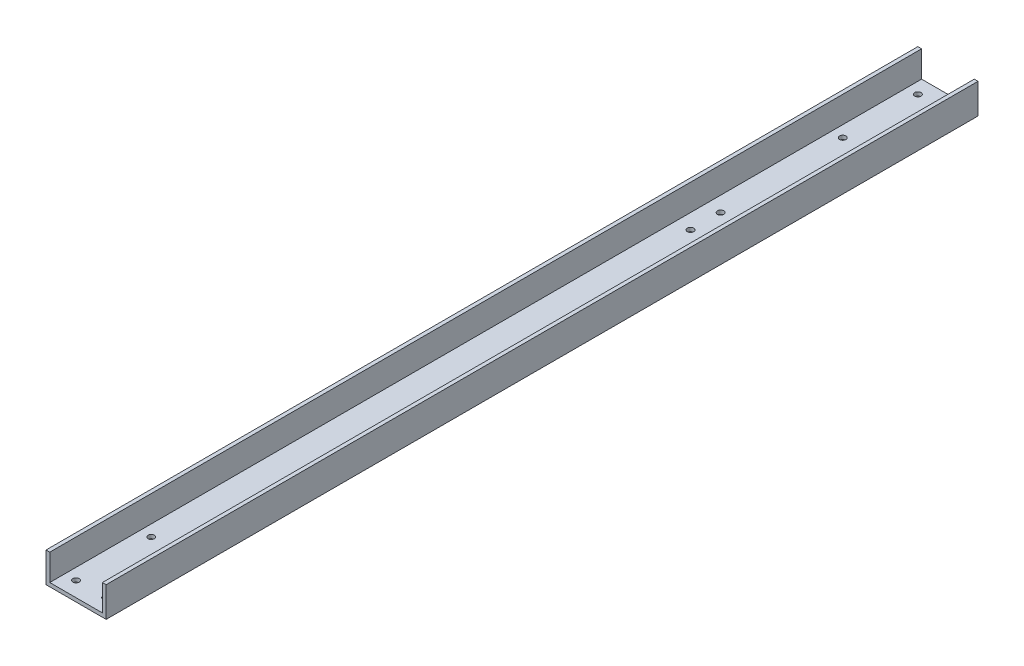
ISO-10303-21;
HEADER;
FILE_DESCRIPTION(('STEP AP214'),'2;1');
FILE_NAME('part.step','',(''),(''),'','','');
FILE_SCHEMA(('AUTOMOTIVE_DESIGN { 1 0 10303 214 1 1 1 1 }'));
ENDSEC;
DATA;
#1=APPLICATION_CONTEXT('core data for automotive mechanical design processes');
#2=APPLICATION_PROTOCOL_DEFINITION('international standard','automotive_design',2000,#1);
#3=PRODUCT_CONTEXT('',#1,'mechanical');
#4=PRODUCT('Part','Part','',(#3));
#5=PRODUCT_RELATED_PRODUCT_CATEGORY('part','',(#4));
#6=PRODUCT_DEFINITION_FORMATION('','',#4);
#7=PRODUCT_DEFINITION_CONTEXT('part definition',#1,'design');
#8=PRODUCT_DEFINITION('design','',#6,#7);
#9=PRODUCT_DEFINITION_SHAPE('','',#8);
#10=(LENGTH_UNIT() NAMED_UNIT(*) SI_UNIT(.MILLI.,.METRE.));
#11=(NAMED_UNIT(*) PLANE_ANGLE_UNIT() SI_UNIT($,.RADIAN.));
#12=(NAMED_UNIT(*) SI_UNIT($,.STERADIAN.) SOLID_ANGLE_UNIT());
#13=UNCERTAINTY_MEASURE_WITH_UNIT(LENGTH_MEASURE(1.E-05),#10,'distance_accuracy_value','');
#14=(GEOMETRIC_REPRESENTATION_CONTEXT(3) GLOBAL_UNCERTAINTY_ASSIGNED_CONTEXT((#13)) GLOBAL_UNIT_ASSIGNED_CONTEXT((#10,
#11,#12)) REPRESENTATION_CONTEXT('',''));
#15=CARTESIAN_POINT('',(0.,0.,0.));
#16=DIRECTION('',(0.,0.,1.));
#17=DIRECTION('',(1.,0.,0.));
#18=AXIS2_PLACEMENT_3D('',#15,#16,#17);
#19=CARTESIAN_POINT('',(0.,0.,736.6));
#20=DIRECTION('',(1.,0.,0.));
#21=DIRECTION('',(0.,0.,-1.));
#22=AXIS2_PLACEMENT_3D('',#19,#20,#21);
#23=PLANE('',#22);
#24=DIRECTION('',(0.,-1.,0.));
#25=VECTOR('',#24,1.);
#26=CARTESIAN_POINT('',(0.,0.,0.));
#27=LINE('',#26,#25);
#28=CARTESIAN_POINT('',(0.,25.4,0.));
#29=VERTEX_POINT('',#28);
#30=CARTESIAN_POINT('',(0.,0.,0.));
#31=VERTEX_POINT('',#30);
#32=EDGE_CURVE('E138',#29,#31,#27,.T.);
#33=ORIENTED_EDGE('',*,*,#32,.T.);
#34=DIRECTION('',(0.,0.,-1.));
#35=VECTOR('',#34,1.);
#36=CARTESIAN_POINT('',(0.,0.,736.6));
#37=LINE('',#36,#35);
#38=CARTESIAN_POINT('',(0.,0.,736.6));
#39=VERTEX_POINT('',#38);
#40=EDGE_CURVE('E11',#39,#31,#37,.T.);
#41=ORIENTED_EDGE('',*,*,#40,.F.);
#42=DIRECTION('',(0.,-1.,0.));
#43=VECTOR('',#42,1.);
#44=CARTESIAN_POINT('',(0.,0.,736.6));
#45=LINE('',#44,#43);
#46=CARTESIAN_POINT('',(0.,25.4,736.6));
#47=VERTEX_POINT('',#46);
#48=EDGE_CURVE('E157',#47,#39,#45,.T.);
#49=ORIENTED_EDGE('',*,*,#48,.F.);
#50=DIRECTION('',(0.,0.,-1.));
#51=VECTOR('',#50,1.);
#52=CARTESIAN_POINT('',(0.,25.4,736.6));
#53=LINE('',#52,#51);
#54=EDGE_CURVE('E134',#47,#29,#53,.T.);
#55=ORIENTED_EDGE('',*,*,#54,.T.);
#56=EDGE_LOOP('',(#33,#41,#49,#55));
#57=FACE_BOUND('',#56,.T.);
#58=ADVANCED_FACE('F38',(#57),#23,.F.);
#59=CARTESIAN_POINT('',(0.,0.,736.6));
#60=DIRECTION('',(0.,1.,0.));
#61=DIRECTION('',(0.,0.,1.));
#62=AXIS2_PLACEMENT_3D('',#59,#60,#61);
#63=PLANE('',#62);
#64=CARTESIAN_POINT('',(15.8750000000001,0.,207.937100000006));
#65=DIRECTION('',(0.,1.,0.));
#66=DIRECTION('',(0.,0.,1.));
#67=AXIS2_PLACEMENT_3D('',#64,#65,#66);
#68=CIRCLE('',#67,2.667);
#69=CARTESIAN_POINT('',(15.8750000000001,0.,210.604100000006));
#70=VERTEX_POINT('',#69);
#71=EDGE_CURVE('E255',#70,#70,#68,.F.);
#72=ORIENTED_EDGE('',*,*,#71,.F.);
#73=EDGE_LOOP('',(#72));
#74=FACE_BOUND('',#73,.T.);
#75=CARTESIAN_POINT('',(34.9250000000001,0.,182.537100000006));
#76=DIRECTION('',(0.,1.,0.));
#77=DIRECTION('',(0.,0.,1.));
#78=AXIS2_PLACEMENT_3D('',#75,#76,#77);
#79=CIRCLE('',#78,2.667);
#80=CARTESIAN_POINT('',(34.9250000000001,0.,185.204100000006));
#81=VERTEX_POINT('',#80);
#82=EDGE_CURVE('E264',#81,#81,#79,.F.);
#83=ORIENTED_EDGE('',*,*,#82,.F.);
#84=EDGE_LOOP('',(#83));
#85=FACE_BOUND('',#84,.T.);
#86=CARTESIAN_POINT('',(15.8750000000001,0.,182.537100000006));
#87=DIRECTION('',(0.,1.,0.));
#88=DIRECTION('',(0.,0.,1.));
#89=AXIS2_PLACEMENT_3D('',#86,#87,#88);
#90=CIRCLE('',#89,2.667);
#91=CARTESIAN_POINT('',(15.8750000000001,0.,185.204100000006));
#92=VERTEX_POINT('',#91);
#93=EDGE_CURVE('E256',#92,#92,#90,.F.);
#94=ORIENTED_EDGE('',*,*,#93,.F.);
#95=EDGE_LOOP('',(#94));
#96=FACE_BOUND('',#95,.T.);
#97=CARTESIAN_POINT('',(34.9250000000001,0.,207.937100000006));
#98=DIRECTION('',(0.,1.,0.));
#99=DIRECTION('',(0.,0.,1.));
#100=AXIS2_PLACEMENT_3D('',#97,#98,#99);
#101=CIRCLE('',#100,2.667);
#102=CARTESIAN_POINT('',(34.9250000000001,0.,210.604100000006));
#103=VERTEX_POINT('',#102);
#104=EDGE_CURVE('E213',#103,#103,#101,.F.);
#105=ORIENTED_EDGE('',*,*,#104,.F.);
#106=EDGE_LOOP('',(#105));
#107=FACE_BOUND('',#106,.T.);
#108=CARTESIAN_POINT('',(12.7,0.,660.4));
#109=DIRECTION('',(0.,1.,0.));
#110=DIRECTION('',(0.,0.,1.));
#111=AXIS2_PLACEMENT_3D('',#108,#109,#110);
#112=CIRCLE('',#111,2.667);
#113=CARTESIAN_POINT('',(12.7,0.,663.067));
#114=VERTEX_POINT('',#113);
#115=EDGE_CURVE('E203',#114,#114,#112,.F.);
#116=ORIENTED_EDGE('',*,*,#115,.F.);
#117=EDGE_LOOP('',(#116));
#118=FACE_BOUND('',#117,.T.);
#119=CARTESIAN_POINT('',(38.1,0.,660.4));
#120=DIRECTION('',(0.,1.,0.));
#121=DIRECTION('',(0.,0.,1.));
#122=AXIS2_PLACEMENT_3D('',#119,#120,#121);
#123=CIRCLE('',#122,2.667);
#124=CARTESIAN_POINT('',(38.1,0.,663.067));
#125=VERTEX_POINT('',#124);
#126=EDGE_CURVE('E239',#125,#125,#123,.F.);
#127=ORIENTED_EDGE('',*,*,#126,.F.);
#128=EDGE_LOOP('',(#127));
#129=FACE_BOUND('',#128,.T.);
#130=CARTESIAN_POINT('',(38.1,0.,723.9));
#131=DIRECTION('',(0.,1.,0.));
#132=DIRECTION('',(0.,0.,1.));
#133=AXIS2_PLACEMENT_3D('',#130,#131,#132);
#134=CIRCLE('',#133,2.667);
#135=CARTESIAN_POINT('',(38.1,0.,726.567));
#136=VERTEX_POINT('',#135);
#137=EDGE_CURVE('E233',#136,#136,#134,.F.);
#138=ORIENTED_EDGE('',*,*,#137,.F.);
#139=EDGE_LOOP('',(#138));
#140=FACE_BOUND('',#139,.T.);
#141=CARTESIAN_POINT('',(38.1,0.,12.7));
#142=DIRECTION('',(0.,1.,0.));
#143=DIRECTION('',(0.,0.,1.));
#144=AXIS2_PLACEMENT_3D('',#141,#142,#143);
#145=CIRCLE('',#144,2.667);
#146=CARTESIAN_POINT('',(38.1,0.,15.367));
#147=VERTEX_POINT('',#146);
#148=EDGE_CURVE('E227',#147,#147,#145,.F.);
#149=ORIENTED_EDGE('',*,*,#148,.F.);
#150=EDGE_LOOP('',(#149));
#151=FACE_BOUND('',#150,.T.);
#152=CARTESIAN_POINT('',(38.1,0.,76.2));
#153=DIRECTION('',(0.,1.,0.));
#154=DIRECTION('',(0.,0.,1.));
#155=AXIS2_PLACEMENT_3D('',#152,#153,#154);
#156=CIRCLE('',#155,2.667);
#157=CARTESIAN_POINT('',(38.1,0.,78.867));
#158=VERTEX_POINT('',#157);
#159=EDGE_CURVE('E220',#158,#158,#156,.F.);
#160=ORIENTED_EDGE('',*,*,#159,.F.);
#161=EDGE_LOOP('',(#160));
#162=FACE_BOUND('',#161,.T.);
#163=CARTESIAN_POINT('',(12.7,0.,12.7));
#164=DIRECTION('',(0.,1.,0.));
#165=DIRECTION('',(0.,0.,1.));
#166=AXIS2_PLACEMENT_3D('',#163,#164,#165);
#167=CIRCLE('',#166,2.667);
#168=CARTESIAN_POINT('',(12.7,0.,15.367));
#169=VERTEX_POINT('',#168);
#170=EDGE_CURVE('E214',#169,#169,#167,.F.);
#171=ORIENTED_EDGE('',*,*,#170,.F.);
#172=EDGE_LOOP('',(#171));
#173=FACE_BOUND('',#172,.T.);
#174=CARTESIAN_POINT('',(12.7,0.,76.2));
#175=DIRECTION('',(0.,1.,0.));
#176=DIRECTION('',(0.,0.,1.));
#177=AXIS2_PLACEMENT_3D('',#174,#175,#176);
#178=CIRCLE('',#177,2.667);
#179=CARTESIAN_POINT('',(12.7,0.,78.867));
#180=VERTEX_POINT('',#179);
#181=EDGE_CURVE('E204',#180,#180,#178,.F.);
#182=ORIENTED_EDGE('',*,*,#181,.F.);
#183=EDGE_LOOP('',(#182));
#184=FACE_BOUND('',#183,.T.);
#185=CARTESIAN_POINT('',(12.7,0.,723.9));
#186=DIRECTION('',(0.,1.,0.));
#187=DIRECTION('',(0.,0.,1.));
#188=AXIS2_PLACEMENT_3D('',#185,#186,#187);
#189=CIRCLE('',#188,2.667);
#190=CARTESIAN_POINT('',(12.7,0.,726.567));
#191=VERTEX_POINT('',#190);
#192=EDGE_CURVE('E143',#191,#191,#189,.F.);
#193=ORIENTED_EDGE('',*,*,#192,.F.);
#194=EDGE_LOOP('',(#193));
#195=FACE_BOUND('',#194,.T.);
#196=DIRECTION('',(1.,0.,0.));
#197=VECTOR('',#196,1.);
#198=CARTESIAN_POINT('',(0.,0.,0.));
#199=LINE('',#198,#197);
#200=CARTESIAN_POINT('',(50.8,0.,0.));
#201=VERTEX_POINT('',#200);
#202=EDGE_CURVE('E142',#31,#201,#199,.T.);
#203=ORIENTED_EDGE('',*,*,#202,.T.);
#204=DIRECTION('',(0.,0.,-1.));
#205=VECTOR('',#204,1.);
#206=CARTESIAN_POINT('',(50.8,0.,736.6));
#207=LINE('',#206,#205);
#208=CARTESIAN_POINT('',(50.8,0.,736.6));
#209=VERTEX_POINT('',#208);
#210=EDGE_CURVE('E47',#209,#201,#207,.T.);
#211=ORIENTED_EDGE('',*,*,#210,.F.);
#212=DIRECTION('',(1.,0.,0.));
#213=VECTOR('',#212,1.);
#214=CARTESIAN_POINT('',(0.,0.,736.6));
#215=LINE('',#214,#213);
#216=EDGE_CURVE('E100',#39,#209,#215,.T.);
#217=ORIENTED_EDGE('',*,*,#216,.F.);
#218=ORIENTED_EDGE('',*,*,#40,.T.);
#219=EDGE_LOOP('',(#203,#211,#217,#218));
#220=FACE_BOUND('',#219,.T.);
#221=ADVANCED_FACE('F312',(#74,#85,#96,#107,#118,#129,#140,#151,#162,#173,#184,#195,#220),#63,.F.);
#222=CARTESIAN_POINT('',(50.8,0.,736.6));
#223=DIRECTION('',(-1.,0.,0.));
#224=DIRECTION('',(0.,0.,1.));
#225=AXIS2_PLACEMENT_3D('',#222,#223,#224);
#226=PLANE('',#225);
#227=DIRECTION('',(0.,1.,0.));
#228=VECTOR('',#227,1.);
#229=CARTESIAN_POINT('',(50.8,0.,0.));
#230=LINE('',#229,#228);
#231=CARTESIAN_POINT('',(50.8,25.4,0.));
#232=VERTEX_POINT('',#231);
#233=EDGE_CURVE('E145',#201,#232,#230,.T.);
#234=ORIENTED_EDGE('',*,*,#233,.T.);
#235=DIRECTION('',(0.,0.,-1.));
#236=VECTOR('',#235,1.);
#237=CARTESIAN_POINT('',(50.8,25.4,736.6));
#238=LINE('',#237,#236);
#239=CARTESIAN_POINT('',(50.8,25.4,736.6));
#240=VERTEX_POINT('',#239);
#241=EDGE_CURVE('E168',#240,#232,#238,.T.);
#242=ORIENTED_EDGE('',*,*,#241,.F.);
#243=DIRECTION('',(0.,1.,0.));
#244=VECTOR('',#243,1.);
#245=CARTESIAN_POINT('',(50.8,0.,736.6));
#246=LINE('',#245,#244);
#247=EDGE_CURVE('E180',#209,#240,#246,.T.);
#248=ORIENTED_EDGE('',*,*,#247,.F.);
#249=ORIENTED_EDGE('',*,*,#210,.T.);
#250=EDGE_LOOP('',(#234,#242,#248,#249));
#251=FACE_BOUND('',#250,.T.);
#252=ADVANCED_FACE('F178',(#251),#226,.F.);
#253=CARTESIAN_POINT('',(47.625,25.4,736.6));
#254=DIRECTION('',(0.,-1.,0.));
#255=DIRECTION('',(0.,0.,-1.));
#256=AXIS2_PLACEMENT_3D('',#253,#254,#255);
#257=PLANE('',#256);
#258=DIRECTION('',(-1.,0.,0.));
#259=VECTOR('',#258,1.);
#260=CARTESIAN_POINT('',(47.625,25.4,0.));
#261=LINE('',#260,#259);
#262=CARTESIAN_POINT('',(47.625,25.4,0.));
#263=VERTEX_POINT('',#262);
#264=EDGE_CURVE('E147',#232,#263,#261,.T.);
#265=ORIENTED_EDGE('',*,*,#264,.T.);
#266=DIRECTION('',(0.,0.,-1.));
#267=VECTOR('',#266,1.);
#268=CARTESIAN_POINT('',(47.625,25.4,736.6));
#269=LINE('',#268,#267);
#270=CARTESIAN_POINT('',(47.625,25.4,736.6));
#271=VERTEX_POINT('',#270);
#272=EDGE_CURVE('E164',#271,#263,#269,.T.);
#273=ORIENTED_EDGE('',*,*,#272,.F.);
#274=DIRECTION('',(-1.,0.,0.));
#275=VECTOR('',#274,1.);
#276=CARTESIAN_POINT('',(47.625,25.4,736.6));
#277=LINE('',#276,#275);
#278=EDGE_CURVE('E192',#240,#271,#277,.T.);
#279=ORIENTED_EDGE('',*,*,#278,.F.);
#280=ORIENTED_EDGE('',*,*,#241,.T.);
#281=EDGE_LOOP('',(#265,#273,#279,#280));
#282=FACE_BOUND('',#281,.T.);
#283=ADVANCED_FACE('F188',(#282),#257,.F.);
#284=CARTESIAN_POINT('',(47.625,3.175,736.6));
#285=DIRECTION('',(1.,0.,0.));
#286=DIRECTION('',(0.,0.,-1.));
#287=AXIS2_PLACEMENT_3D('',#284,#285,#286);
#288=PLANE('',#287);
#289=DIRECTION('',(0.,-1.,0.));
#290=VECTOR('',#289,1.);
#291=CARTESIAN_POINT('',(47.625,3.175,0.));
#292=LINE('',#291,#290);
#293=CARTESIAN_POINT('',(47.625,3.175,0.));
#294=VERTEX_POINT('',#293);
#295=EDGE_CURVE('E149',#263,#294,#292,.T.);
#296=ORIENTED_EDGE('',*,*,#295,.T.);
#297=DIRECTION('',(0.,0.,-1.));
#298=VECTOR('',#297,1.);
#299=CARTESIAN_POINT('',(47.625,3.175,736.6));
#300=LINE('',#299,#298);
#301=CARTESIAN_POINT('',(47.625,3.175,736.6));
#302=VERTEX_POINT('',#301);
#303=EDGE_CURVE('E129',#302,#294,#300,.T.);
#304=ORIENTED_EDGE('',*,*,#303,.F.);
#305=DIRECTION('',(0.,-1.,0.));
#306=VECTOR('',#305,1.);
#307=CARTESIAN_POINT('',(47.625,3.175,736.6));
#308=LINE('',#307,#306);
#309=EDGE_CURVE('E119',#271,#302,#308,.T.);
#310=ORIENTED_EDGE('',*,*,#309,.F.);
#311=ORIENTED_EDGE('',*,*,#272,.T.);
#312=EDGE_LOOP('',(#296,#304,#310,#311));
#313=FACE_BOUND('',#312,.T.);
#314=ADVANCED_FACE('F191',(#313),#288,.F.);
#315=CARTESIAN_POINT('',(3.175,3.175,736.6));
#316=DIRECTION('',(0.,-1.,0.));
#317=DIRECTION('',(0.,0.,-1.));
#318=AXIS2_PLACEMENT_3D('',#315,#316,#317);
#319=PLANE('',#318);
#320=CARTESIAN_POINT('',(15.8750000000001,3.175,207.937100000006));
#321=DIRECTION('',(0.,1.,0.));
#322=DIRECTION('',(0.,0.,1.));
#323=AXIS2_PLACEMENT_3D('',#320,#321,#322);
#324=CIRCLE('',#323,2.667);
#325=CARTESIAN_POINT('',(15.8750000000001,3.175,210.604100000006));
#326=VERTEX_POINT('',#325);
#327=EDGE_CURVE('E268',#326,#326,#324,.T.);
#328=ORIENTED_EDGE('',*,*,#327,.F.);
#329=EDGE_LOOP('',(#328));
#330=FACE_BOUND('',#329,.T.);
#331=CARTESIAN_POINT('',(34.9250000000001,3.175,182.537100000006));
#332=DIRECTION('',(0.,1.,0.));
#333=DIRECTION('',(0.,0.,1.));
#334=AXIS2_PLACEMENT_3D('',#331,#332,#333);
#335=CIRCLE('',#334,2.667);
#336=CARTESIAN_POINT('',(34.9250000000001,3.175,185.204100000006));
#337=VERTEX_POINT('',#336);
#338=EDGE_CURVE('E259',#337,#337,#335,.T.);
#339=ORIENTED_EDGE('',*,*,#338,.F.);
#340=EDGE_LOOP('',(#339));
#341=FACE_BOUND('',#340,.T.);
#342=CARTESIAN_POINT('',(15.8750000000001,3.175,182.537100000006));
#343=DIRECTION('',(0.,1.,0.));
#344=DIRECTION('',(0.,0.,1.));
#345=AXIS2_PLACEMENT_3D('',#342,#343,#344);
#346=CIRCLE('',#345,2.667);
#347=CARTESIAN_POINT('',(15.8750000000001,3.175,185.204100000006));
#348=VERTEX_POINT('',#347);
#349=EDGE_CURVE('E260',#348,#348,#346,.T.);
#350=ORIENTED_EDGE('',*,*,#349,.F.);
#351=EDGE_LOOP('',(#350));
#352=FACE_BOUND('',#351,.T.);
#353=CARTESIAN_POINT('',(34.9250000000001,3.175,207.937100000006));
#354=DIRECTION('',(0.,1.,0.));
#355=DIRECTION('',(0.,0.,1.));
#356=AXIS2_PLACEMENT_3D('',#353,#354,#355);
#357=CIRCLE('',#356,2.667);
#358=CARTESIAN_POINT('',(34.9250000000001,3.175,210.604100000006));
#359=VERTEX_POINT('',#358);
#360=EDGE_CURVE('E251',#359,#359,#357,.T.);
#361=ORIENTED_EDGE('',*,*,#360,.F.);
#362=EDGE_LOOP('',(#361));
#363=FACE_BOUND('',#362,.T.);
#364=CARTESIAN_POINT('',(12.7,3.175,660.4));
#365=DIRECTION('',(0.,1.,0.));
#366=DIRECTION('',(0.,0.,1.));
#367=AXIS2_PLACEMENT_3D('',#364,#365,#366);
#368=CIRCLE('',#367,2.667);
#369=CARTESIAN_POINT('',(12.7,3.175,663.067));
#370=VERTEX_POINT('',#369);
#371=EDGE_CURVE('E242',#370,#370,#368,.T.);
#372=ORIENTED_EDGE('',*,*,#371,.F.);
#373=EDGE_LOOP('',(#372));
#374=FACE_BOUND('',#373,.T.);
#375=CARTESIAN_POINT('',(38.1,3.175,660.4));
#376=DIRECTION('',(0.,1.,0.));
#377=DIRECTION('',(0.,0.,1.));
#378=AXIS2_PLACEMENT_3D('',#375,#376,#377);
#379=CIRCLE('',#378,2.667);
#380=CARTESIAN_POINT('',(38.1,3.175,663.067));
#381=VERTEX_POINT('',#380);
#382=EDGE_CURVE('E236',#381,#381,#379,.T.);
#383=ORIENTED_EDGE('',*,*,#382,.F.);
#384=EDGE_LOOP('',(#383));
#385=FACE_BOUND('',#384,.T.);
#386=CARTESIAN_POINT('',(38.1,3.175,723.9));
#387=DIRECTION('',(0.,1.,0.));
#388=DIRECTION('',(0.,0.,1.));
#389=AXIS2_PLACEMENT_3D('',#386,#387,#388);
#390=CIRCLE('',#389,2.667);
#391=CARTESIAN_POINT('',(38.1,3.175,726.567));
#392=VERTEX_POINT('',#391);
#393=EDGE_CURVE('E230',#392,#392,#390,.T.);
#394=ORIENTED_EDGE('',*,*,#393,.F.);
#395=EDGE_LOOP('',(#394));
#396=FACE_BOUND('',#395,.T.);
#397=CARTESIAN_POINT('',(38.1,3.175,12.7));
#398=DIRECTION('',(0.,1.,0.));
#399=DIRECTION('',(0.,0.,-1.));
#400=AXIS2_PLACEMENT_3D('',#397,#398,#399);
#401=CIRCLE('',#400,2.667);
#402=CARTESIAN_POINT('',(38.1,3.175,10.033));
#403=VERTEX_POINT('',#402);
#404=EDGE_CURVE('E224',#403,#403,#401,.T.);
#405=ORIENTED_EDGE('',*,*,#404,.F.);
#406=EDGE_LOOP('',(#405));
#407=FACE_BOUND('',#406,.T.);
#408=CARTESIAN_POINT('',(38.1,3.175,76.2));
#409=DIRECTION('',(0.,1.,0.));
#410=DIRECTION('',(0.,0.,-1.));
#411=AXIS2_PLACEMENT_3D('',#408,#409,#410);
#412=CIRCLE('',#411,2.667);
#413=CARTESIAN_POINT('',(38.1,3.175,73.533));
#414=VERTEX_POINT('',#413);
#415=EDGE_CURVE('E217',#414,#414,#412,.T.);
#416=ORIENTED_EDGE('',*,*,#415,.F.);
#417=EDGE_LOOP('',(#416));
#418=FACE_BOUND('',#417,.T.);
#419=CARTESIAN_POINT('',(12.7,3.175,12.7));
#420=DIRECTION('',(0.,1.,0.));
#421=DIRECTION('',(0.,0.,-1.));
#422=AXIS2_PLACEMENT_3D('',#419,#420,#421);
#423=CIRCLE('',#422,2.667);
#424=CARTESIAN_POINT('',(12.7,3.175,10.033));
#425=VERTEX_POINT('',#424);
#426=EDGE_CURVE('E208',#425,#425,#423,.T.);
#427=ORIENTED_EDGE('',*,*,#426,.F.);
#428=EDGE_LOOP('',(#427));
#429=FACE_BOUND('',#428,.T.);
#430=CARTESIAN_POINT('',(12.7,3.175,76.2));
#431=DIRECTION('',(0.,1.,0.));
#432=DIRECTION('',(0.,0.,-1.));
#433=AXIS2_PLACEMENT_3D('',#430,#431,#432);
#434=CIRCLE('',#433,2.667);
#435=CARTESIAN_POINT('',(12.7,3.175,73.533));
#436=VERTEX_POINT('',#435);
#437=EDGE_CURVE('E209',#436,#436,#434,.T.);
#438=ORIENTED_EDGE('',*,*,#437,.F.);
#439=EDGE_LOOP('',(#438));
#440=FACE_BOUND('',#439,.T.);
#441=CARTESIAN_POINT('',(12.7,3.175,723.9));
#442=DIRECTION('',(0.,1.,0.));
#443=DIRECTION('',(0.,0.,1.));
#444=AXIS2_PLACEMENT_3D('',#441,#442,#443);
#445=CIRCLE('',#444,2.667);
#446=CARTESIAN_POINT('',(12.7,3.175,726.567));
#447=VERTEX_POINT('',#446);
#448=EDGE_CURVE('E200',#447,#447,#445,.T.);
#449=ORIENTED_EDGE('',*,*,#448,.F.);
#450=EDGE_LOOP('',(#449));
#451=FACE_BOUND('',#450,.T.);
#452=DIRECTION('',(-1.,0.,0.));
#453=VECTOR('',#452,1.);
#454=CARTESIAN_POINT('',(3.175,3.175,0.));
#455=LINE('',#454,#453);
#456=CARTESIAN_POINT('',(3.175,3.175,0.));
#457=VERTEX_POINT('',#456);
#458=EDGE_CURVE('E127',#294,#457,#455,.T.);
#459=ORIENTED_EDGE('',*,*,#458,.T.);
#460=DIRECTION('',(0.,0.,-1.));
#461=VECTOR('',#460,1.);
#462=CARTESIAN_POINT('',(3.175,3.175,736.6));
#463=LINE('',#462,#461);
#464=CARTESIAN_POINT('',(3.175,3.175,736.6));
#465=VERTEX_POINT('',#464);
#466=EDGE_CURVE('E124',#465,#457,#463,.T.);
#467=ORIENTED_EDGE('',*,*,#466,.F.);
#468=DIRECTION('',(-1.,0.,0.));
#469=VECTOR('',#468,1.);
#470=CARTESIAN_POINT('',(3.175,3.175,736.6));
#471=LINE('',#470,#469);
#472=EDGE_CURVE('E113',#302,#465,#471,.T.);
#473=ORIENTED_EDGE('',*,*,#472,.F.);
#474=ORIENTED_EDGE('',*,*,#303,.T.);
#475=EDGE_LOOP('',(#459,#467,#473,#474));
#476=FACE_BOUND('',#475,.T.);
#477=ADVANCED_FACE('F125',(#330,#341,#352,#363,#374,#385,#396,#407,#418,#429,#440,#451,#476),
#319,.F.);
#478=CARTESIAN_POINT('',(3.175,3.175,736.6));
#479=DIRECTION('',(-1.,0.,0.));
#480=DIRECTION('',(0.,0.,1.));
#481=AXIS2_PLACEMENT_3D('',#478,#479,#480);
#482=PLANE('',#481);
#483=DIRECTION('',(0.,1.,0.));
#484=VECTOR('',#483,1.);
#485=CARTESIAN_POINT('',(3.175,3.175,0.));
#486=LINE('',#485,#484);
#487=CARTESIAN_POINT('',(3.175,25.4,0.));
#488=VERTEX_POINT('',#487);
#489=EDGE_CURVE('E86',#457,#488,#486,.T.);
#490=ORIENTED_EDGE('',*,*,#489,.T.);
#491=DIRECTION('',(0.,0.,-1.));
#492=VECTOR('',#491,1.);
#493=CARTESIAN_POINT('',(3.175,25.4,736.6));
#494=LINE('',#493,#492);
#495=CARTESIAN_POINT('',(3.175,25.4,736.6));
#496=VERTEX_POINT('',#495);
#497=EDGE_CURVE('E130',#496,#488,#494,.T.);
#498=ORIENTED_EDGE('',*,*,#497,.F.);
#499=DIRECTION('',(0.,1.,0.));
#500=VECTOR('',#499,1.);
#501=CARTESIAN_POINT('',(3.175,3.175,736.6));
#502=LINE('',#501,#500);
#503=EDGE_CURVE('E117',#465,#496,#502,.T.);
#504=ORIENTED_EDGE('',*,*,#503,.F.);
#505=ORIENTED_EDGE('',*,*,#466,.T.);
#506=EDGE_LOOP('',(#490,#498,#504,#505));
#507=FACE_BOUND('',#506,.T.);
#508=ADVANCED_FACE('F132',(#507),#482,.F.);
#509=CARTESIAN_POINT('',(0.,25.4,736.6));
#510=DIRECTION('',(0.,-1.,0.));
#511=DIRECTION('',(0.,0.,-1.));
#512=AXIS2_PLACEMENT_3D('',#509,#510,#511);
#513=PLANE('',#512);
#514=DIRECTION('',(-1.,0.,0.));
#515=VECTOR('',#514,1.);
#516=CARTESIAN_POINT('',(0.,25.4,0.));
#517=LINE('',#516,#515);
#518=EDGE_CURVE('E92',#488,#29,#517,.T.);
#519=ORIENTED_EDGE('',*,*,#518,.T.);
#520=ORIENTED_EDGE('',*,*,#54,.F.);
#521=DIRECTION('',(-1.,0.,0.));
#522=VECTOR('',#521,1.);
#523=CARTESIAN_POINT('',(0.,25.4,736.6));
#524=LINE('',#523,#522);
#525=EDGE_CURVE('E55',#496,#47,#524,.T.);
#526=ORIENTED_EDGE('',*,*,#525,.F.);
#527=ORIENTED_EDGE('',*,*,#497,.T.);
#528=EDGE_LOOP('',(#519,#520,#526,#527));
#529=FACE_BOUND('',#528,.T.);
#530=ADVANCED_FACE('F318',(#529),#513,.F.);
#531=CARTESIAN_POINT('',(0.,0.,736.6));
#532=DIRECTION('',(0.,0.,-1.));
#533=DIRECTION('',(-1.,0.,0.));
#534=AXIS2_PLACEMENT_3D('',#531,#532,#533);
#535=PLANE('',#534);
#536=ORIENTED_EDGE('',*,*,#48,.T.);
#537=ORIENTED_EDGE('',*,*,#216,.T.);
#538=ORIENTED_EDGE('',*,*,#247,.T.);
#539=ORIENTED_EDGE('',*,*,#278,.T.);
#540=ORIENTED_EDGE('',*,*,#309,.T.);
#541=ORIENTED_EDGE('',*,*,#472,.T.);
#542=ORIENTED_EDGE('',*,*,#503,.T.);
#543=ORIENTED_EDGE('',*,*,#525,.T.);
#544=EDGE_LOOP('',(#536,#537,#538,#539,#540,#541,#542,#543));
#545=FACE_BOUND('',#544,.T.);
#546=ADVANCED_FACE('F115',(#545),#535,.F.);
#547=CARTESIAN_POINT('',(0.,0.,0.));
#548=DIRECTION('',(0.,0.,-1.));
#549=DIRECTION('',(-1.,0.,0.));
#550=AXIS2_PLACEMENT_3D('',#547,#548,#549);
#551=PLANE('',#550);
#552=ORIENTED_EDGE('',*,*,#32,.F.);
#553=ORIENTED_EDGE('',*,*,#518,.F.);
#554=ORIENTED_EDGE('',*,*,#489,.F.);
#555=ORIENTED_EDGE('',*,*,#458,.F.);
#556=ORIENTED_EDGE('',*,*,#295,.F.);
#557=ORIENTED_EDGE('',*,*,#264,.F.);
#558=ORIENTED_EDGE('',*,*,#233,.F.);
#559=ORIENTED_EDGE('',*,*,#202,.F.);
#560=EDGE_LOOP('',(#552,#553,#554,#555,#556,#557,#558,#559));
#561=FACE_BOUND('',#560,.T.);
#562=ADVANCED_FACE('F184',(#561),#551,.T.);
#563=CARTESIAN_POINT('',(12.7,-0.00100000000000013,723.9));
#564=DIRECTION('',(0.,1.,0.));
#565=DIRECTION('',(0.,0.,1.));
#566=AXIS2_PLACEMENT_3D('',#563,#564,#565);
#567=CYLINDRICAL_SURFACE('',#566,2.667);
#568=ORIENTED_EDGE('',*,*,#448,.T.);
#569=EDGE_LOOP('',(#568));
#570=FACE_BOUND('',#569,.T.);
#571=ORIENTED_EDGE('',*,*,#192,.T.);
#572=EDGE_LOOP('',(#571));
#573=FACE_BOUND('',#572,.T.);
#574=ADVANCED_FACE('F305',(#570,#573),#567,.F.);
#575=CARTESIAN_POINT('',(12.7,-0.00100000000000013,76.2));
#576=DIRECTION('',(0.,1.,0.));
#577=DIRECTION('',(0.,0.,1.));
#578=AXIS2_PLACEMENT_3D('',#575,#576,#577);
#579=CYLINDRICAL_SURFACE('',#578,2.667);
#580=ORIENTED_EDGE('',*,*,#437,.T.);
#581=EDGE_LOOP('',(#580));
#582=FACE_BOUND('',#581,.T.);
#583=ORIENTED_EDGE('',*,*,#181,.T.);
#584=EDGE_LOOP('',(#583));
#585=FACE_BOUND('',#584,.T.);
#586=ADVANCED_FACE('F308',(#582,#585),#579,.F.);
#587=CARTESIAN_POINT('',(12.7,-0.00100000000000013,12.7));
#588=DIRECTION('',(0.,1.,0.));
#589=DIRECTION('',(0.,0.,1.));
#590=AXIS2_PLACEMENT_3D('',#587,#588,#589);
#591=CYLINDRICAL_SURFACE('',#590,2.667);
#592=ORIENTED_EDGE('',*,*,#426,.T.);
#593=EDGE_LOOP('',(#592));
#594=FACE_BOUND('',#593,.T.);
#595=ORIENTED_EDGE('',*,*,#170,.T.);
#596=EDGE_LOOP('',(#595));
#597=FACE_BOUND('',#596,.T.);
#598=ADVANCED_FACE('F392',(#594,#597),#591,.F.);
#599=CARTESIAN_POINT('',(38.1,-0.00100000000000013,76.2));
#600=DIRECTION('',(0.,1.,0.));
#601=DIRECTION('',(0.,0.,1.));
#602=AXIS2_PLACEMENT_3D('',#599,#600,#601);
#603=CYLINDRICAL_SURFACE('',#602,2.667);
#604=ORIENTED_EDGE('',*,*,#415,.T.);
#605=EDGE_LOOP('',(#604));
#606=FACE_BOUND('',#605,.T.);
#607=ORIENTED_EDGE('',*,*,#159,.T.);
#608=EDGE_LOOP('',(#607));
#609=FACE_BOUND('',#608,.T.);
#610=ADVANCED_FACE('F402',(#606,#609),#603,.F.);
#611=CARTESIAN_POINT('',(38.1,-0.00100000000000013,12.7));
#612=DIRECTION('',(0.,1.,0.));
#613=DIRECTION('',(0.,0.,1.));
#614=AXIS2_PLACEMENT_3D('',#611,#612,#613);
#615=CYLINDRICAL_SURFACE('',#614,2.667);
#616=ORIENTED_EDGE('',*,*,#404,.T.);
#617=EDGE_LOOP('',(#616));
#618=FACE_BOUND('',#617,.T.);
#619=ORIENTED_EDGE('',*,*,#148,.T.);
#620=EDGE_LOOP('',(#619));
#621=FACE_BOUND('',#620,.T.);
#622=ADVANCED_FACE('F412',(#618,#621),#615,.F.);
#623=CARTESIAN_POINT('',(38.1,-0.00100000000000013,723.9));
#624=DIRECTION('',(0.,1.,0.));
#625=DIRECTION('',(0.,0.,1.));
#626=AXIS2_PLACEMENT_3D('',#623,#624,#625);
#627=CYLINDRICAL_SURFACE('',#626,2.667);
#628=ORIENTED_EDGE('',*,*,#393,.T.);
#629=EDGE_LOOP('',(#628));
#630=FACE_BOUND('',#629,.T.);
#631=ORIENTED_EDGE('',*,*,#137,.T.);
#632=EDGE_LOOP('',(#631));
#633=FACE_BOUND('',#632,.T.);
#634=ADVANCED_FACE('F422',(#630,#633),#627,.F.);
#635=CARTESIAN_POINT('',(38.1,-0.00100000000000013,660.4));
#636=DIRECTION('',(0.,1.,0.));
#637=DIRECTION('',(0.,0.,1.));
#638=AXIS2_PLACEMENT_3D('',#635,#636,#637);
#639=CYLINDRICAL_SURFACE('',#638,2.667);
#640=ORIENTED_EDGE('',*,*,#382,.T.);
#641=EDGE_LOOP('',(#640));
#642=FACE_BOUND('',#641,.T.);
#643=ORIENTED_EDGE('',*,*,#126,.T.);
#644=EDGE_LOOP('',(#643));
#645=FACE_BOUND('',#644,.T.);
#646=ADVANCED_FACE('F432',(#642,#645),#639,.F.);
#647=CARTESIAN_POINT('',(12.7,-0.00100000000000013,660.4));
#648=DIRECTION('',(0.,1.,0.));
#649=DIRECTION('',(0.,0.,1.));
#650=AXIS2_PLACEMENT_3D('',#647,#648,#649);
#651=CYLINDRICAL_SURFACE('',#650,2.667);
#652=ORIENTED_EDGE('',*,*,#371,.T.);
#653=EDGE_LOOP('',(#652));
#654=FACE_BOUND('',#653,.T.);
#655=ORIENTED_EDGE('',*,*,#115,.T.);
#656=EDGE_LOOP('',(#655));
#657=FACE_BOUND('',#656,.T.);
#658=ADVANCED_FACE('F442',(#654,#657),#651,.F.);
#659=CARTESIAN_POINT('',(34.9250000000001,-0.00100000000000013,207.937100000006));
#660=DIRECTION('',(0.,1.,0.));
#661=DIRECTION('',(0.,0.,1.));
#662=AXIS2_PLACEMENT_3D('',#659,#660,#661);
#663=CYLINDRICAL_SURFACE('',#662,2.667);
#664=ORIENTED_EDGE('',*,*,#360,.T.);
#665=EDGE_LOOP('',(#664));
#666=FACE_BOUND('',#665,.T.);
#667=ORIENTED_EDGE('',*,*,#104,.T.);
#668=EDGE_LOOP('',(#667));
#669=FACE_BOUND('',#668,.T.);
#670=ADVANCED_FACE('F451',(#666,#669),#663,.F.);
#671=CARTESIAN_POINT('',(15.8750000000001,-0.00100000000000013,182.537100000006));
#672=DIRECTION('',(0.,1.,0.));
#673=DIRECTION('',(0.,0.,1.));
#674=AXIS2_PLACEMENT_3D('',#671,#672,#673);
#675=CYLINDRICAL_SURFACE('',#674,2.667);
#676=ORIENTED_EDGE('',*,*,#349,.T.);
#677=EDGE_LOOP('',(#676));
#678=FACE_BOUND('',#677,.T.);
#679=ORIENTED_EDGE('',*,*,#93,.T.);
#680=EDGE_LOOP('',(#679));
#681=FACE_BOUND('',#680,.T.);
#682=ADVANCED_FACE('F470',(#678,#681),#675,.F.);
#683=CARTESIAN_POINT('',(34.9250000000001,-0.00100000000000013,182.537100000006));
#684=DIRECTION('',(0.,1.,0.));
#685=DIRECTION('',(0.,0.,1.));
#686=AXIS2_PLACEMENT_3D('',#683,#684,#685);
#687=CYLINDRICAL_SURFACE('',#686,2.667);
#688=ORIENTED_EDGE('',*,*,#338,.T.);
#689=EDGE_LOOP('',(#688));
#690=FACE_BOUND('',#689,.T.);
#691=ORIENTED_EDGE('',*,*,#82,.T.);
#692=EDGE_LOOP('',(#691));
#693=FACE_BOUND('',#692,.T.);
#694=ADVANCED_FACE('F480',(#690,#693),#687,.F.);
#695=CARTESIAN_POINT('',(15.8750000000001,-0.00100000000000013,207.937100000006));
#696=DIRECTION('',(0.,1.,0.));
#697=DIRECTION('',(0.,0.,1.));
#698=AXIS2_PLACEMENT_3D('',#695,#696,#697);
#699=CYLINDRICAL_SURFACE('',#698,2.667);
#700=ORIENTED_EDGE('',*,*,#327,.T.);
#701=EDGE_LOOP('',(#700));
#702=FACE_BOUND('',#701,.T.);
#703=ORIENTED_EDGE('',*,*,#71,.T.);
#704=EDGE_LOOP('',(#703));
#705=FACE_BOUND('',#704,.T.);
#706=ADVANCED_FACE('F277',(#702,#705),#699,.F.);
#707=CLOSED_SHELL('',(#58,#221,#252,#283,#314,#477,#508,#530,#546,#562,#574,#586,#598,#610,#622,
#634,#646,#658,#670,#682,#694,#706));
#708=MANIFOLD_SOLID_BREP('B2',#707);
#709=ADVANCED_BREP_SHAPE_REPRESENTATION('',(#18,#708),#14);
#710=SHAPE_DEFINITION_REPRESENTATION(#9,#709);
ENDSEC;
END-ISO-10303-21;
